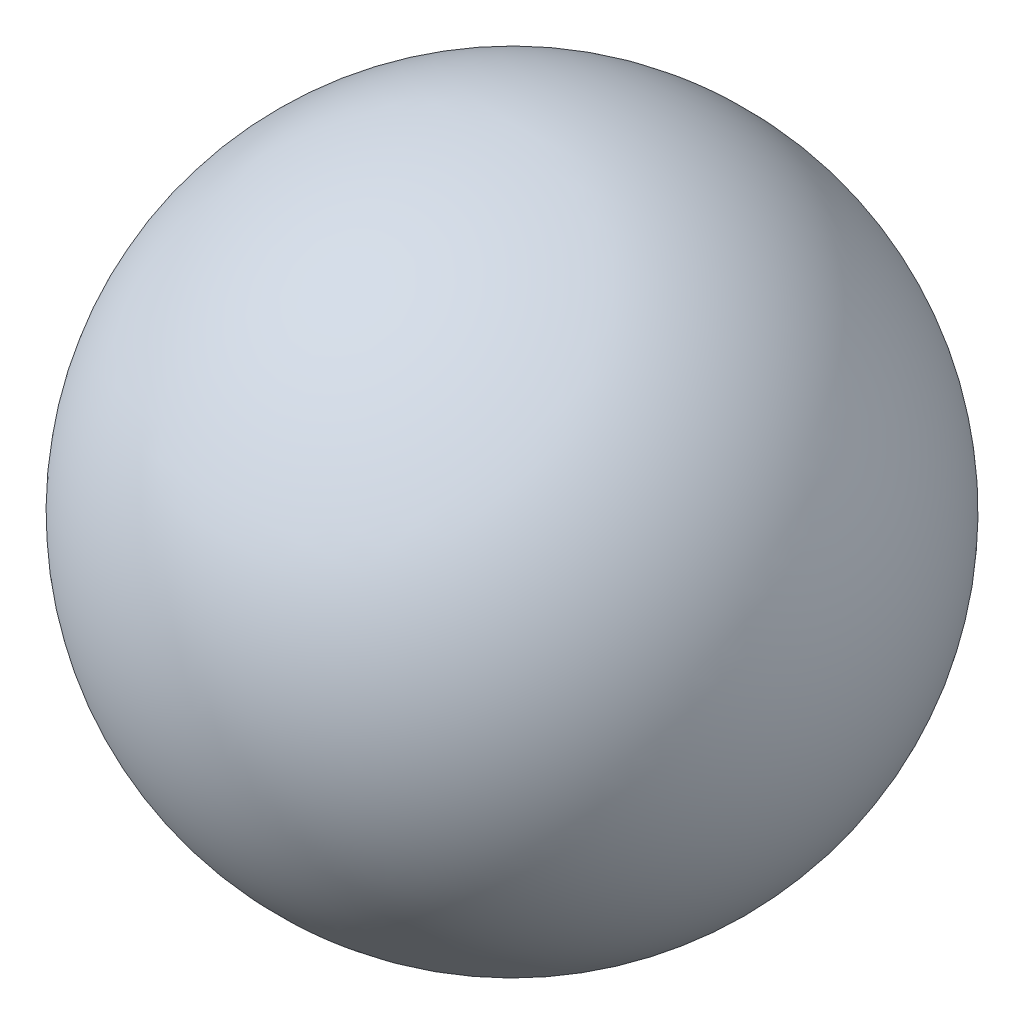
ISO-10303-21;
HEADER;
FILE_DESCRIPTION(('STEP AP214'),'2;1');
FILE_NAME('part.step','',(''),(''),'','','');
FILE_SCHEMA(('AUTOMOTIVE_DESIGN { 1 0 10303 214 1 1 1 1 }'));
ENDSEC;
DATA;
#1=APPLICATION_CONTEXT('core data for automotive mechanical design processes');
#2=APPLICATION_PROTOCOL_DEFINITION('international standard','automotive_design',2000,#1);
#3=PRODUCT_CONTEXT('',#1,'mechanical');
#4=PRODUCT('Part','Part','',(#3));
#5=PRODUCT_RELATED_PRODUCT_CATEGORY('part','',(#4));
#6=PRODUCT_DEFINITION_FORMATION('','',#4);
#7=PRODUCT_DEFINITION_CONTEXT('part definition',#1,'design');
#8=PRODUCT_DEFINITION('design','',#6,#7);
#9=PRODUCT_DEFINITION_SHAPE('','',#8);
#10=(LENGTH_UNIT() NAMED_UNIT(*) SI_UNIT(.MILLI.,.METRE.));
#11=(NAMED_UNIT(*) PLANE_ANGLE_UNIT() SI_UNIT($,.RADIAN.));
#12=(NAMED_UNIT(*) SI_UNIT($,.STERADIAN.) SOLID_ANGLE_UNIT());
#13=UNCERTAINTY_MEASURE_WITH_UNIT(LENGTH_MEASURE(1.E-05),#10,'distance_accuracy_value','');
#14=(GEOMETRIC_REPRESENTATION_CONTEXT(3) GLOBAL_UNCERTAINTY_ASSIGNED_CONTEXT((#13)) GLOBAL_UNIT_ASSIGNED_CONTEXT((#10,
#11,#12)) REPRESENTATION_CONTEXT('',''));
#15=CARTESIAN_POINT('',(0.,0.,0.));
#16=DIRECTION('',(0.,0.,1.));
#17=DIRECTION('',(1.,0.,0.));
#18=AXIS2_PLACEMENT_3D('',#15,#16,#17);
#19=CARTESIAN_POINT('',(57.535,-50.5771212990556,35.043976563036));
#20=DIRECTION('',(0.,-0.821971206602399,0.569529047122793));
#21=DIRECTION('',(0.173648177666934,-0.560876621172181,-0.809483617014841));
#22=AXIS2_PLACEMENT_3D('',#19,#20,#21);
#23=SPHERICAL_SURFACE('',#22,6.75);
#24=CARTESIAN_POINT('',(57.535,-56.1254269436218,38.8882976311149));
#25=VERTEX_POINT('',#24);
#26=VERTEX_LOOP('',#25);
#27=FACE_BOUND('',#26,.T.);
#28=CARTESIAN_POINT('',(57.535,-45.0288156544894,31.1996554949571));
#29=VERTEX_POINT('',#28);
#30=VERTEX_LOOP('',#29);
#31=FACE_BOUND('',#30,.T.);
#32=ADVANCED_FACE('F16',(#27,#31),#23,.T.);
#33=CLOSED_SHELL('',(#32));
#34=MANIFOLD_SOLID_BREP('B1',#33);
#35=ADVANCED_BREP_SHAPE_REPRESENTATION('',(#18,#34),#14);
#36=SHAPE_DEFINITION_REPRESENTATION(#9,#35);
ENDSEC;
END-ISO-10303-21;
